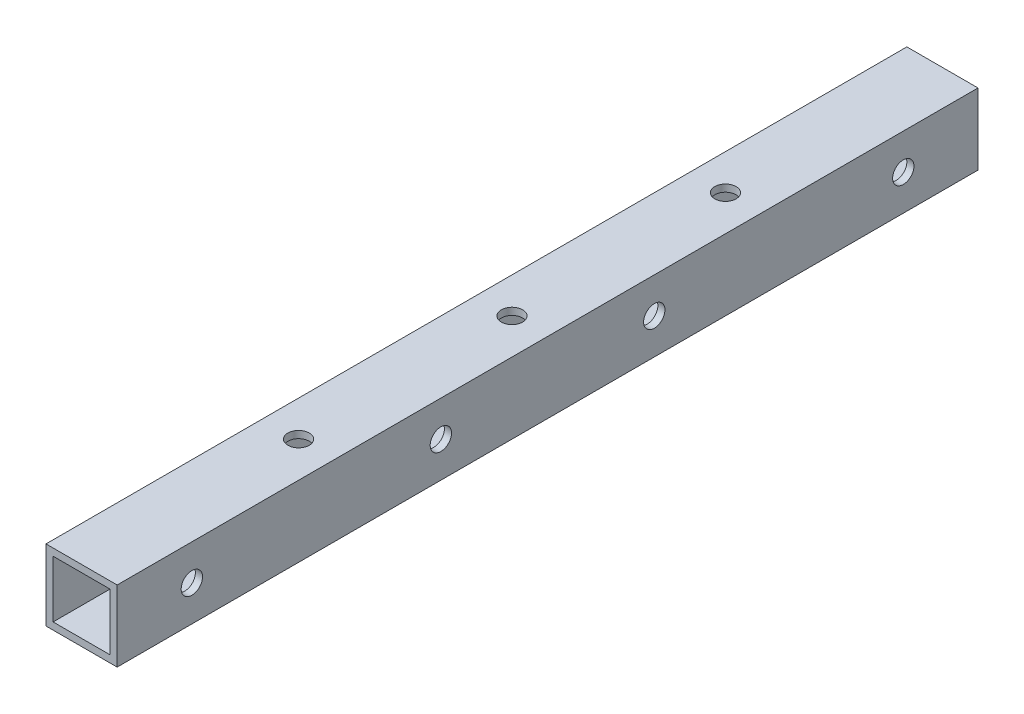
ISO-10303-21;
HEADER;
FILE_DESCRIPTION(('STEP AP214'),'2;1');
FILE_NAME('part.step','',(''),(''),'','','');
FILE_SCHEMA(('AUTOMOTIVE_DESIGN { 1 0 10303 214 1 1 1 1 }'));
ENDSEC;
DATA;
#1=APPLICATION_CONTEXT('core data for automotive mechanical design processes');
#2=APPLICATION_PROTOCOL_DEFINITION('international standard','automotive_design',2000,#1);
#3=PRODUCT_CONTEXT('',#1,'mechanical');
#4=PRODUCT('Part','Part','',(#3));
#5=PRODUCT_RELATED_PRODUCT_CATEGORY('part','',(#4));
#6=PRODUCT_DEFINITION_FORMATION('','',#4);
#7=PRODUCT_DEFINITION_CONTEXT('part definition',#1,'design');
#8=PRODUCT_DEFINITION('design','',#6,#7);
#9=PRODUCT_DEFINITION_SHAPE('','',#8);
#10=(LENGTH_UNIT() NAMED_UNIT(*) SI_UNIT(.MILLI.,.METRE.));
#11=(NAMED_UNIT(*) PLANE_ANGLE_UNIT() SI_UNIT($,.RADIAN.));
#12=(NAMED_UNIT(*) SI_UNIT($,.STERADIAN.) SOLID_ANGLE_UNIT());
#13=UNCERTAINTY_MEASURE_WITH_UNIT(LENGTH_MEASURE(1.E-05),#10,'distance_accuracy_value','');
#14=(GEOMETRIC_REPRESENTATION_CONTEXT(3) GLOBAL_UNCERTAINTY_ASSIGNED_CONTEXT((#13)) GLOBAL_UNIT_ASSIGNED_CONTEXT((#10,
#11,#12)) REPRESENTATION_CONTEXT('',''));
#15=CARTESIAN_POINT('',(0.,0.,0.));
#16=DIRECTION('',(0.,0.,1.));
#17=DIRECTION('',(1.,0.,0.));
#18=AXIS2_PLACEMENT_3D('',#15,#16,#17);
#19=CARTESIAN_POINT('',(0.,0.,121.));
#20=DIRECTION('',(0.,0.,1.));
#21=DIRECTION('',(1.,0.,0.));
#22=AXIS2_PLACEMENT_3D('',#19,#20,#21);
#23=PLANE('',#22);
#24=DIRECTION('',(-1.,0.,0.));
#25=VECTOR('',#24,1.);
#26=CARTESIAN_POINT('',(0.,5.,121.));
#27=LINE('',#26,#25);
#28=CARTESIAN_POINT('',(4.99999999999999,5.,121.));
#29=VERTEX_POINT('',#28);
#30=CARTESIAN_POINT('',(-5.,5.,121.));
#31=VERTEX_POINT('',#30);
#32=EDGE_CURVE('E167',#29,#31,#27,.T.);
#33=ORIENTED_EDGE('',*,*,#32,.T.);
#34=DIRECTION('',(0.,-1.,0.));
#35=VECTOR('',#34,1.);
#36=CARTESIAN_POINT('',(-5.,0.,121.));
#37=LINE('',#36,#35);
#38=CARTESIAN_POINT('',(-5.,-4.99999999999999,121.));
#39=VERTEX_POINT('',#38);
#40=EDGE_CURVE('E170',#31,#39,#37,.T.);
#41=ORIENTED_EDGE('',*,*,#40,.T.);
#42=DIRECTION('',(-1.,0.,0.));
#43=VECTOR('',#42,1.);
#44=CARTESIAN_POINT('',(0.,-4.99999999999999,121.));
#45=LINE('',#44,#43);
#46=CARTESIAN_POINT('',(4.99999999999999,-4.99999999999999,121.));
#47=VERTEX_POINT('',#46);
#48=EDGE_CURVE('E173',#47,#39,#45,.T.);
#49=ORIENTED_EDGE('',*,*,#48,.F.);
#50=DIRECTION('',(0.,-1.,0.));
#51=VECTOR('',#50,1.);
#52=CARTESIAN_POINT('',(4.99999999999999,0.,121.));
#53=LINE('',#52,#51);
#54=EDGE_CURVE('E176',#29,#47,#53,.T.);
#55=ORIENTED_EDGE('',*,*,#54,.F.);
#56=EDGE_LOOP('',(#33,#41,#49,#55));
#57=FACE_BOUND('',#56,.T.);
#58=DIRECTION('',(0.,-1.,0.));
#59=VECTOR('',#58,1.);
#60=CARTESIAN_POINT('',(-4.,0.,121.));
#61=LINE('',#60,#59);
#62=CARTESIAN_POINT('',(-4.,4.,121.));
#63=VERTEX_POINT('',#62);
#64=CARTESIAN_POINT('',(-4.,-3.99999999999999,121.));
#65=VERTEX_POINT('',#64);
#66=EDGE_CURVE('E139',#63,#65,#61,.T.);
#67=ORIENTED_EDGE('',*,*,#66,.F.);
#68=DIRECTION('',(-1.,0.,0.));
#69=VECTOR('',#68,1.);
#70=CARTESIAN_POINT('',(0.,4.,121.));
#71=LINE('',#70,#69);
#72=CARTESIAN_POINT('',(3.99999999999999,4.,121.));
#73=VERTEX_POINT('',#72);
#74=EDGE_CURVE('E130',#73,#63,#71,.T.);
#75=ORIENTED_EDGE('',*,*,#74,.F.);
#76=DIRECTION('',(0.,-1.,0.));
#77=VECTOR('',#76,1.);
#78=CARTESIAN_POINT('',(3.99999999999999,0.,121.));
#79=LINE('',#78,#77);
#80=CARTESIAN_POINT('',(3.99999999999999,-3.99999999999999,121.));
#81=VERTEX_POINT('',#80);
#82=EDGE_CURVE('E150',#73,#81,#79,.T.);
#83=ORIENTED_EDGE('',*,*,#82,.T.);
#84=DIRECTION('',(-1.,0.,0.));
#85=VECTOR('',#84,1.);
#86=CARTESIAN_POINT('',(0.,-3.99999999999999,121.));
#87=LINE('',#86,#85);
#88=EDGE_CURVE('E80',#81,#65,#87,.T.);
#89=ORIENTED_EDGE('',*,*,#88,.T.);
#90=EDGE_LOOP('',(#67,#75,#83,#89));
#91=FACE_BOUND('',#90,.T.);
#92=ADVANCED_FACE('F63',(#57,#91),#23,.T.);
#93=CARTESIAN_POINT('',(0.,0.,0.));
#94=DIRECTION('',(0.,0.,1.));
#95=DIRECTION('',(1.,0.,0.));
#96=AXIS2_PLACEMENT_3D('',#93,#94,#95);
#97=PLANE('',#96);
#98=DIRECTION('',(-1.,0.,0.));
#99=VECTOR('',#98,1.);
#100=CARTESIAN_POINT('',(0.,5.,0.));
#101=LINE('',#100,#99);
#102=CARTESIAN_POINT('',(4.99999999999999,5.,0.));
#103=VERTEX_POINT('',#102);
#104=CARTESIAN_POINT('',(-5.,5.,0.));
#105=VERTEX_POINT('',#104);
#106=EDGE_CURVE('E146',#103,#105,#101,.T.);
#107=ORIENTED_EDGE('',*,*,#106,.F.);
#108=DIRECTION('',(0.,-1.,0.));
#109=VECTOR('',#108,1.);
#110=CARTESIAN_POINT('',(4.99999999999999,0.,0.));
#111=LINE('',#110,#109);
#112=CARTESIAN_POINT('',(4.99999999999999,-4.99999999999999,0.));
#113=VERTEX_POINT('',#112);
#114=EDGE_CURVE('E171',#103,#113,#111,.T.);
#115=ORIENTED_EDGE('',*,*,#114,.T.);
#116=DIRECTION('',(-1.,0.,0.));
#117=VECTOR('',#116,1.);
#118=CARTESIAN_POINT('',(0.,-4.99999999999999,0.));
#119=LINE('',#118,#117);
#120=CARTESIAN_POINT('',(-5.,-4.99999999999999,0.));
#121=VERTEX_POINT('',#120);
#122=EDGE_CURVE('E185',#113,#121,#119,.T.);
#123=ORIENTED_EDGE('',*,*,#122,.T.);
#124=DIRECTION('',(0.,-1.,0.));
#125=VECTOR('',#124,1.);
#126=CARTESIAN_POINT('',(-5.,0.,0.));
#127=LINE('',#126,#125);
#128=EDGE_CURVE('E182',#105,#121,#127,.T.);
#129=ORIENTED_EDGE('',*,*,#128,.F.);
#130=EDGE_LOOP('',(#107,#115,#123,#129));
#131=FACE_BOUND('',#130,.T.);
#132=DIRECTION('',(-1.,0.,0.));
#133=VECTOR('',#132,1.);
#134=CARTESIAN_POINT('',(0.,4.,0.));
#135=LINE('',#134,#133);
#136=CARTESIAN_POINT('',(3.99999999999999,4.,0.));
#137=VERTEX_POINT('',#136);
#138=CARTESIAN_POINT('',(-4.,4.,0.));
#139=VERTEX_POINT('',#138);
#140=EDGE_CURVE('E88',#137,#139,#135,.T.);
#141=ORIENTED_EDGE('',*,*,#140,.T.);
#142=DIRECTION('',(0.,-1.,0.));
#143=VECTOR('',#142,1.);
#144=CARTESIAN_POINT('',(-4.,0.,0.));
#145=LINE('',#144,#143);
#146=CARTESIAN_POINT('',(-4.,-3.99999999999999,0.));
#147=VERTEX_POINT('',#146);
#148=EDGE_CURVE('E145',#139,#147,#145,.T.);
#149=ORIENTED_EDGE('',*,*,#148,.T.);
#150=DIRECTION('',(-1.,0.,0.));
#151=VECTOR('',#150,1.);
#152=CARTESIAN_POINT('',(0.,-3.99999999999999,0.));
#153=LINE('',#152,#151);
#154=CARTESIAN_POINT('',(3.99999999999999,-3.99999999999999,0.));
#155=VERTEX_POINT('',#154);
#156=EDGE_CURVE('E158',#155,#147,#153,.T.);
#157=ORIENTED_EDGE('',*,*,#156,.F.);
#158=DIRECTION('',(0.,-1.,0.));
#159=VECTOR('',#158,1.);
#160=CARTESIAN_POINT('',(3.99999999999999,0.,0.));
#161=LINE('',#160,#159);
#162=EDGE_CURVE('E140',#137,#155,#161,.T.);
#163=ORIENTED_EDGE('',*,*,#162,.F.);
#164=EDGE_LOOP('',(#141,#149,#157,#163));
#165=FACE_BOUND('',#164,.T.);
#166=ADVANCED_FACE('F295',(#131,#165),#97,.F.);
#167=CARTESIAN_POINT('',(0.,5.,121.));
#168=DIRECTION('',(0.,-1.,0.));
#169=DIRECTION('',(0.,0.,-1.));
#170=AXIS2_PLACEMENT_3D('',#167,#168,#169);
#171=PLANE('',#170);
#172=CARTESIAN_POINT('',(0.,5.,90.5));
#173=DIRECTION('',(0.,1.,0.));
#174=DIRECTION('',(0.,0.,1.));
#175=AXIS2_PLACEMENT_3D('',#172,#173,#174);
#176=CIRCLE('',#175,1.5);
#177=CARTESIAN_POINT('',(0.,5.,92.));
#178=VERTEX_POINT('',#177);
#179=EDGE_CURVE('E342',#178,#178,#176,.T.);
#180=ORIENTED_EDGE('',*,*,#179,.F.);
#181=EDGE_LOOP('',(#180));
#182=FACE_BOUND('',#181,.T.);
#183=CARTESIAN_POINT('',(0.,5.,30.5));
#184=DIRECTION('',(0.,1.,0.));
#185=DIRECTION('',(0.,0.,1.));
#186=AXIS2_PLACEMENT_3D('',#183,#184,#185);
#187=CIRCLE('',#186,1.5);
#188=CARTESIAN_POINT('',(0.,5.,32.));
#189=VERTEX_POINT('',#188);
#190=EDGE_CURVE('E339',#189,#189,#187,.T.);
#191=ORIENTED_EDGE('',*,*,#190,.F.);
#192=EDGE_LOOP('',(#191));
#193=FACE_BOUND('',#192,.T.);
#194=CARTESIAN_POINT('',(0.,5.,60.5));
#195=DIRECTION('',(0.,1.,0.));
#196=DIRECTION('',(0.,0.,1.));
#197=AXIS2_PLACEMENT_3D('',#194,#195,#196);
#198=CIRCLE('',#197,1.5);
#199=CARTESIAN_POINT('',(0.,5.,62.));
#200=VERTEX_POINT('',#199);
#201=EDGE_CURVE('E226',#200,#200,#198,.T.);
#202=ORIENTED_EDGE('',*,*,#201,.F.);
#203=EDGE_LOOP('',(#202));
#204=FACE_BOUND('',#203,.T.);
#205=ORIENTED_EDGE('',*,*,#106,.T.);
#206=DIRECTION('',(0.,0.,-1.));
#207=VECTOR('',#206,1.);
#208=CARTESIAN_POINT('',(-5.,5.,121.));
#209=LINE('',#208,#207);
#210=EDGE_CURVE('E12',#31,#105,#209,.T.);
#211=ORIENTED_EDGE('',*,*,#210,.F.);
#212=ORIENTED_EDGE('',*,*,#32,.F.);
#213=DIRECTION('',(0.,0.,-1.));
#214=VECTOR('',#213,1.);
#215=CARTESIAN_POINT('',(4.99999999999999,5.,121.));
#216=LINE('',#215,#214);
#217=EDGE_CURVE('E179',#29,#103,#216,.T.);
#218=ORIENTED_EDGE('',*,*,#217,.T.);
#219=EDGE_LOOP('',(#205,#211,#212,#218));
#220=FACE_BOUND('',#219,.T.);
#221=ADVANCED_FACE('F65',(#182,#193,#204,#220),#171,.F.);
#222=CARTESIAN_POINT('',(-5.,0.,121.));
#223=DIRECTION('',(1.,0.,0.));
#224=DIRECTION('',(0.,0.,-1.));
#225=AXIS2_PLACEMENT_3D('',#222,#223,#224);
#226=PLANE('',#225);
#227=CARTESIAN_POINT('',(-5.,0.,110.5));
#228=DIRECTION('',(1.,0.,0.));
#229=DIRECTION('',(0.,0.,-1.));
#230=AXIS2_PLACEMENT_3D('',#227,#228,#229);
#231=CIRCLE('',#230,1.5);
#232=CARTESIAN_POINT('',(-5.,0.,109.));
#233=VERTEX_POINT('',#232);
#234=EDGE_CURVE('E198',#233,#233,#231,.T.);
#235=ORIENTED_EDGE('',*,*,#234,.T.);
#236=EDGE_LOOP('',(#235));
#237=FACE_BOUND('',#236,.T.);
#238=CARTESIAN_POINT('',(-5.,0.,75.5));
#239=DIRECTION('',(1.,0.,0.));
#240=DIRECTION('',(0.,0.,-1.));
#241=AXIS2_PLACEMENT_3D('',#238,#239,#240);
#242=CIRCLE('',#241,1.50000000000003);
#243=CARTESIAN_POINT('',(-5.,0.,74.));
#244=VERTEX_POINT('',#243);
#245=EDGE_CURVE('E241',#244,#244,#242,.T.);
#246=ORIENTED_EDGE('',*,*,#245,.T.);
#247=EDGE_LOOP('',(#246));
#248=FACE_BOUND('',#247,.T.);
#249=CARTESIAN_POINT('',(-5.,0.,45.5));
#250=DIRECTION('',(1.,0.,0.));
#251=DIRECTION('',(0.,0.,-1.));
#252=AXIS2_PLACEMENT_3D('',#249,#250,#251);
#253=CIRCLE('',#252,1.5);
#254=CARTESIAN_POINT('',(-5.,0.,44.));
#255=VERTEX_POINT('',#254);
#256=EDGE_CURVE('E247',#255,#255,#253,.T.);
#257=ORIENTED_EDGE('',*,*,#256,.T.);
#258=EDGE_LOOP('',(#257));
#259=FACE_BOUND('',#258,.T.);
#260=CARTESIAN_POINT('',(-5.,0.,10.5));
#261=DIRECTION('',(1.,0.,0.));
#262=DIRECTION('',(0.,0.,-1.));
#263=AXIS2_PLACEMENT_3D('',#260,#261,#262);
#264=CIRCLE('',#263,1.5);
#265=CARTESIAN_POINT('',(-5.,0.,8.99999999999999));
#266=VERTEX_POINT('',#265);
#267=EDGE_CURVE('E232',#266,#266,#264,.T.);
#268=ORIENTED_EDGE('',*,*,#267,.T.);
#269=EDGE_LOOP('',(#268));
#270=FACE_BOUND('',#269,.T.);
#271=ORIENTED_EDGE('',*,*,#128,.T.);
#272=DIRECTION('',(0.,0.,-1.));
#273=VECTOR('',#272,1.);
#274=CARTESIAN_POINT('',(-5.,-4.99999999999999,121.));
#275=LINE('',#274,#273);
#276=EDGE_CURVE('E72',#39,#121,#275,.T.);
#277=ORIENTED_EDGE('',*,*,#276,.F.);
#278=ORIENTED_EDGE('',*,*,#40,.F.);
#279=ORIENTED_EDGE('',*,*,#210,.T.);
#280=EDGE_LOOP('',(#271,#277,#278,#279));
#281=FACE_BOUND('',#280,.T.);
#282=ADVANCED_FACE('F285',(#237,#248,#259,#270,#281),#226,.F.);
#283=CARTESIAN_POINT('',(0.,-4.99999999999999,121.));
#284=DIRECTION('',(0.,-1.,0.));
#285=DIRECTION('',(0.,0.,-1.));
#286=AXIS2_PLACEMENT_3D('',#283,#284,#285);
#287=PLANE('',#286);
#288=CARTESIAN_POINT('',(0.,-4.99999999999999,90.5));
#289=DIRECTION('',(0.,1.,0.));
#290=DIRECTION('',(0.,0.,1.));
#291=AXIS2_PLACEMENT_3D('',#288,#289,#290);
#292=CIRCLE('',#291,1.5);
#293=CARTESIAN_POINT('',(0.,-4.99999999999999,92.));
#294=VERTEX_POINT('',#293);
#295=EDGE_CURVE('E330',#294,#294,#292,.T.);
#296=ORIENTED_EDGE('',*,*,#295,.T.);
#297=EDGE_LOOP('',(#296));
#298=FACE_BOUND('',#297,.T.);
#299=CARTESIAN_POINT('',(0.,-4.99999999999999,30.5));
#300=DIRECTION('',(0.,1.,0.));
#301=DIRECTION('',(0.,0.,1.));
#302=AXIS2_PLACEMENT_3D('',#299,#300,#301);
#303=CIRCLE('',#302,1.5);
#304=CARTESIAN_POINT('',(0.,-4.99999999999999,32.));
#305=VERTEX_POINT('',#304);
#306=EDGE_CURVE('E334',#305,#305,#303,.T.);
#307=ORIENTED_EDGE('',*,*,#306,.T.);
#308=EDGE_LOOP('',(#307));
#309=FACE_BOUND('',#308,.T.);
#310=CARTESIAN_POINT('',(0.,-4.99999999999999,60.5));
#311=DIRECTION('',(0.,1.,0.));
#312=DIRECTION('',(0.,0.,1.));
#313=AXIS2_PLACEMENT_3D('',#310,#311,#312);
#314=CIRCLE('',#313,1.5);
#315=CARTESIAN_POINT('',(0.,-4.99999999999999,62.));
#316=VERTEX_POINT('',#315);
#317=EDGE_CURVE('E213',#316,#316,#314,.T.);
#318=ORIENTED_EDGE('',*,*,#317,.T.);
#319=EDGE_LOOP('',(#318));
#320=FACE_BOUND('',#319,.T.);
#321=ORIENTED_EDGE('',*,*,#122,.F.);
#322=DIRECTION('',(0.,0.,-1.));
#323=VECTOR('',#322,1.);
#324=CARTESIAN_POINT('',(4.99999999999999,-4.99999999999999,121.));
#325=LINE('',#324,#323);
#326=EDGE_CURVE('E191',#47,#113,#325,.T.);
#327=ORIENTED_EDGE('',*,*,#326,.F.);
#328=ORIENTED_EDGE('',*,*,#48,.T.);
#329=ORIENTED_EDGE('',*,*,#276,.T.);
#330=EDGE_LOOP('',(#321,#327,#328,#329));
#331=FACE_BOUND('',#330,.T.);
#332=ADVANCED_FACE('F288',(#298,#309,#320,#331),#287,.T.);
#333=CARTESIAN_POINT('',(4.99999999999999,0.,121.));
#334=DIRECTION('',(1.,0.,0.));
#335=DIRECTION('',(0.,0.,-1.));
#336=AXIS2_PLACEMENT_3D('',#333,#334,#335);
#337=PLANE('',#336);
#338=CARTESIAN_POINT('',(4.99999999999999,0.,110.5));
#339=DIRECTION('',(1.,0.,0.));
#340=DIRECTION('',(0.,0.,-1.));
#341=AXIS2_PLACEMENT_3D('',#338,#339,#340);
#342=CIRCLE('',#341,1.5);
#343=CARTESIAN_POINT('',(4.99999999999999,0.,109.));
#344=VERTEX_POINT('',#343);
#345=EDGE_CURVE('E235',#344,#344,#342,.T.);
#346=ORIENTED_EDGE('',*,*,#345,.F.);
#347=EDGE_LOOP('',(#346));
#348=FACE_BOUND('',#347,.T.);
#349=CARTESIAN_POINT('',(4.99999999999999,0.,75.5));
#350=DIRECTION('',(1.,0.,0.));
#351=DIRECTION('',(0.,0.,-1.));
#352=AXIS2_PLACEMENT_3D('',#349,#350,#351);
#353=CIRCLE('',#352,1.50000000000003);
#354=CARTESIAN_POINT('',(4.99999999999999,0.,74.));
#355=VERTEX_POINT('',#354);
#356=EDGE_CURVE('E238',#355,#355,#353,.T.);
#357=ORIENTED_EDGE('',*,*,#356,.F.);
#358=EDGE_LOOP('',(#357));
#359=FACE_BOUND('',#358,.T.);
#360=CARTESIAN_POINT('',(4.99999999999999,0.,45.5));
#361=DIRECTION('',(1.,0.,0.));
#362=DIRECTION('',(0.,0.,-1.));
#363=AXIS2_PLACEMENT_3D('',#360,#361,#362);
#364=CIRCLE('',#363,1.5);
#365=CARTESIAN_POINT('',(4.99999999999999,0.,44.));
#366=VERTEX_POINT('',#365);
#367=EDGE_CURVE('E244',#366,#366,#364,.T.);
#368=ORIENTED_EDGE('',*,*,#367,.F.);
#369=EDGE_LOOP('',(#368));
#370=FACE_BOUND('',#369,.T.);
#371=CARTESIAN_POINT('',(4.99999999999999,0.,10.5));
#372=DIRECTION('',(1.,0.,0.));
#373=DIRECTION('',(0.,0.,-1.));
#374=AXIS2_PLACEMENT_3D('',#371,#372,#373);
#375=CIRCLE('',#374,1.5);
#376=CARTESIAN_POINT('',(4.99999999999999,0.,8.99999999999999));
#377=VERTEX_POINT('',#376);
#378=EDGE_CURVE('E250',#377,#377,#375,.T.);
#379=ORIENTED_EDGE('',*,*,#378,.F.);
#380=EDGE_LOOP('',(#379));
#381=FACE_BOUND('',#380,.T.);
#382=ORIENTED_EDGE('',*,*,#114,.F.);
#383=ORIENTED_EDGE('',*,*,#217,.F.);
#384=ORIENTED_EDGE('',*,*,#54,.T.);
#385=ORIENTED_EDGE('',*,*,#326,.T.);
#386=EDGE_LOOP('',(#382,#383,#384,#385));
#387=FACE_BOUND('',#386,.T.);
#388=ADVANCED_FACE('F303',(#348,#359,#370,#381,#387),#337,.T.);
#389=CARTESIAN_POINT('',(0.,4.,121.));
#390=DIRECTION('',(0.,-1.,0.));
#391=DIRECTION('',(0.,0.,-1.));
#392=AXIS2_PLACEMENT_3D('',#389,#390,#391);
#393=PLANE('',#392);
#394=CARTESIAN_POINT('',(0.,4.,90.5));
#395=DIRECTION('',(0.,-1.,0.));
#396=DIRECTION('',(0.,0.,-1.));
#397=AXIS2_PLACEMENT_3D('',#394,#395,#396);
#398=CIRCLE('',#397,1.5);
#399=CARTESIAN_POINT('',(0.,4.,89.));
#400=VERTEX_POINT('',#399);
#401=EDGE_CURVE('E229',#400,#400,#398,.T.);
#402=ORIENTED_EDGE('',*,*,#401,.F.);
#403=EDGE_LOOP('',(#402));
#404=FACE_BOUND('',#403,.T.);
#405=CARTESIAN_POINT('',(0.,4.,30.5));
#406=DIRECTION('',(0.,-1.,0.));
#407=DIRECTION('',(0.,0.,-1.));
#408=AXIS2_PLACEMENT_3D('',#405,#406,#407);
#409=CIRCLE('',#408,1.5);
#410=CARTESIAN_POINT('',(0.,4.,29.));
#411=VERTEX_POINT('',#410);
#412=EDGE_CURVE('E216',#411,#411,#409,.T.);
#413=ORIENTED_EDGE('',*,*,#412,.F.);
#414=EDGE_LOOP('',(#413));
#415=FACE_BOUND('',#414,.T.);
#416=CARTESIAN_POINT('',(0.,4.,60.5));
#417=DIRECTION('',(0.,-1.,0.));
#418=DIRECTION('',(0.,0.,-1.));
#419=AXIS2_PLACEMENT_3D('',#416,#417,#418);
#420=CIRCLE('',#419,1.5);
#421=CARTESIAN_POINT('',(0.,4.,59.));
#422=VERTEX_POINT('',#421);
#423=EDGE_CURVE('E212',#422,#422,#420,.T.);
#424=ORIENTED_EDGE('',*,*,#423,.F.);
#425=EDGE_LOOP('',(#424));
#426=FACE_BOUND('',#425,.T.);
#427=ORIENTED_EDGE('',*,*,#140,.F.);
#428=DIRECTION('',(0.,0.,-1.));
#429=VECTOR('',#428,1.);
#430=CARTESIAN_POINT('',(3.99999999999999,4.,121.));
#431=LINE('',#430,#429);
#432=EDGE_CURVE('E134',#73,#137,#431,.T.);
#433=ORIENTED_EDGE('',*,*,#432,.F.);
#434=ORIENTED_EDGE('',*,*,#74,.T.);
#435=DIRECTION('',(0.,0.,-1.));
#436=VECTOR('',#435,1.);
#437=CARTESIAN_POINT('',(-4.,4.,121.));
#438=LINE('',#437,#436);
#439=EDGE_CURVE('E133',#63,#139,#438,.T.);
#440=ORIENTED_EDGE('',*,*,#439,.T.);
#441=EDGE_LOOP('',(#427,#433,#434,#440));
#442=FACE_BOUND('',#441,.T.);
#443=ADVANCED_FACE('F132',(#404,#415,#426,#442),#393,.T.);
#444=CARTESIAN_POINT('',(-4.,0.,121.));
#445=DIRECTION('',(1.,0.,0.));
#446=DIRECTION('',(0.,0.,-1.));
#447=AXIS2_PLACEMENT_3D('',#444,#445,#446);
#448=PLANE('',#447);
#449=CARTESIAN_POINT('',(-4.,0.,110.5));
#450=DIRECTION('',(1.,0.,0.));
#451=DIRECTION('',(0.,0.,-1.));
#452=AXIS2_PLACEMENT_3D('',#449,#450,#451);
#453=CIRCLE('',#452,1.5);
#454=CARTESIAN_POINT('',(-4.,0.,109.));
#455=VERTEX_POINT('',#454);
#456=EDGE_CURVE('E156',#455,#455,#453,.T.);
#457=ORIENTED_EDGE('',*,*,#456,.F.);
#458=EDGE_LOOP('',(#457));
#459=FACE_BOUND('',#458,.T.);
#460=CARTESIAN_POINT('',(-4.,0.,75.5));
#461=DIRECTION('',(1.,0.,0.));
#462=DIRECTION('',(0.,0.,-1.));
#463=AXIS2_PLACEMENT_3D('',#460,#461,#462);
#464=CIRCLE('',#463,1.50000000000003);
#465=CARTESIAN_POINT('',(-4.,0.,74.));
#466=VERTEX_POINT('',#465);
#467=EDGE_CURVE('E206',#466,#466,#464,.T.);
#468=ORIENTED_EDGE('',*,*,#467,.F.);
#469=EDGE_LOOP('',(#468));
#470=FACE_BOUND('',#469,.T.);
#471=CARTESIAN_POINT('',(-4.,0.,45.5));
#472=DIRECTION('',(1.,0.,0.));
#473=DIRECTION('',(0.,0.,-1.));
#474=AXIS2_PLACEMENT_3D('',#471,#472,#473);
#475=CIRCLE('',#474,1.5);
#476=CARTESIAN_POINT('',(-4.,0.,44.));
#477=VERTEX_POINT('',#476);
#478=EDGE_CURVE('E202',#477,#477,#475,.T.);
#479=ORIENTED_EDGE('',*,*,#478,.F.);
#480=EDGE_LOOP('',(#479));
#481=FACE_BOUND('',#480,.T.);
#482=CARTESIAN_POINT('',(-4.,0.,10.5));
#483=DIRECTION('',(1.,0.,0.));
#484=DIRECTION('',(0.,0.,-1.));
#485=AXIS2_PLACEMENT_3D('',#482,#483,#484);
#486=CIRCLE('',#485,1.5);
#487=CARTESIAN_POINT('',(-4.,0.,8.99999999999999));
#488=VERTEX_POINT('',#487);
#489=EDGE_CURVE('E197',#488,#488,#486,.T.);
#490=ORIENTED_EDGE('',*,*,#489,.F.);
#491=EDGE_LOOP('',(#490));
#492=FACE_BOUND('',#491,.T.);
#493=ORIENTED_EDGE('',*,*,#148,.F.);
#494=ORIENTED_EDGE('',*,*,#439,.F.);
#495=ORIENTED_EDGE('',*,*,#66,.T.);
#496=DIRECTION('',(0.,0.,-1.));
#497=VECTOR('',#496,1.);
#498=CARTESIAN_POINT('',(-4.,-3.99999999999999,121.));
#499=LINE('',#498,#497);
#500=EDGE_CURVE('E147',#65,#147,#499,.T.);
#501=ORIENTED_EDGE('',*,*,#500,.T.);
#502=EDGE_LOOP('',(#493,#494,#495,#501));
#503=FACE_BOUND('',#502,.T.);
#504=ADVANCED_FACE('F143',(#459,#470,#481,#492,#503),#448,.T.);
#505=CARTESIAN_POINT('',(0.,-3.99999999999999,121.));
#506=DIRECTION('',(0.,-1.,0.));
#507=DIRECTION('',(0.,0.,-1.));
#508=AXIS2_PLACEMENT_3D('',#505,#506,#507);
#509=PLANE('',#508);
#510=CARTESIAN_POINT('',(0.,-3.99999999999999,90.5));
#511=DIRECTION('',(0.,-1.,0.));
#512=DIRECTION('',(0.,0.,-1.));
#513=AXIS2_PLACEMENT_3D('',#510,#511,#512);
#514=CIRCLE('',#513,1.5);
#515=CARTESIAN_POINT('',(0.,-3.99999999999999,89.));
#516=VERTEX_POINT('',#515);
#517=EDGE_CURVE('E67',#516,#516,#514,.T.);
#518=ORIENTED_EDGE('',*,*,#517,.T.);
#519=EDGE_LOOP('',(#518));
#520=FACE_BOUND('',#519,.T.);
#521=CARTESIAN_POINT('',(0.,-3.99999999999999,30.5));
#522=DIRECTION('',(0.,-1.,0.));
#523=DIRECTION('',(0.,0.,-1.));
#524=AXIS2_PLACEMENT_3D('',#521,#522,#523);
#525=CIRCLE('',#524,1.5);
#526=CARTESIAN_POINT('',(0.,-3.99999999999999,29.));
#527=VERTEX_POINT('',#526);
#528=EDGE_CURVE('E214',#527,#527,#525,.T.);
#529=ORIENTED_EDGE('',*,*,#528,.T.);
#530=EDGE_LOOP('',(#529));
#531=FACE_BOUND('',#530,.T.);
#532=CARTESIAN_POINT('',(0.,-3.99999999999999,60.5));
#533=DIRECTION('',(0.,-1.,0.));
#534=DIRECTION('',(0.,0.,-1.));
#535=AXIS2_PLACEMENT_3D('',#532,#533,#534);
#536=CIRCLE('',#535,1.5);
#537=CARTESIAN_POINT('',(0.,-3.99999999999999,59.));
#538=VERTEX_POINT('',#537);
#539=EDGE_CURVE('E210',#538,#538,#536,.T.);
#540=ORIENTED_EDGE('',*,*,#539,.T.);
#541=EDGE_LOOP('',(#540));
#542=FACE_BOUND('',#541,.T.);
#543=ORIENTED_EDGE('',*,*,#156,.T.);
#544=ORIENTED_EDGE('',*,*,#500,.F.);
#545=ORIENTED_EDGE('',*,*,#88,.F.);
#546=DIRECTION('',(0.,0.,-1.));
#547=VECTOR('',#546,1.);
#548=CARTESIAN_POINT('',(3.99999999999999,-3.99999999999999,121.));
#549=LINE('',#548,#547);
#550=EDGE_CURVE('E164',#81,#155,#549,.T.);
#551=ORIENTED_EDGE('',*,*,#550,.T.);
#552=EDGE_LOOP('',(#543,#544,#545,#551));
#553=FACE_BOUND('',#552,.T.);
#554=ADVANCED_FACE('F268',(#520,#531,#542,#553),#509,.F.);
#555=CARTESIAN_POINT('',(3.99999999999999,0.,121.));
#556=DIRECTION('',(1.,0.,0.));
#557=DIRECTION('',(0.,0.,-1.));
#558=AXIS2_PLACEMENT_3D('',#555,#556,#557);
#559=PLANE('',#558);
#560=CARTESIAN_POINT('',(3.99999999999999,0.,110.5));
#561=DIRECTION('',(1.,0.,0.));
#562=DIRECTION('',(0.,0.,-1.));
#563=AXIS2_PLACEMENT_3D('',#560,#561,#562);
#564=CIRCLE('',#563,1.5);
#565=CARTESIAN_POINT('',(3.99999999999999,0.,109.));
#566=VERTEX_POINT('',#565);
#567=EDGE_CURVE('E207',#566,#566,#564,.T.);
#568=ORIENTED_EDGE('',*,*,#567,.T.);
#569=EDGE_LOOP('',(#568));
#570=FACE_BOUND('',#569,.T.);
#571=CARTESIAN_POINT('',(3.99999999999999,0.,75.5));
#572=DIRECTION('',(1.,0.,0.));
#573=DIRECTION('',(0.,0.,-1.));
#574=AXIS2_PLACEMENT_3D('',#571,#572,#573);
#575=CIRCLE('',#574,1.50000000000003);
#576=CARTESIAN_POINT('',(3.99999999999999,0.,74.));
#577=VERTEX_POINT('',#576);
#578=EDGE_CURVE('E203',#577,#577,#575,.T.);
#579=ORIENTED_EDGE('',*,*,#578,.T.);
#580=EDGE_LOOP('',(#579));
#581=FACE_BOUND('',#580,.T.);
#582=CARTESIAN_POINT('',(3.99999999999999,0.,45.5));
#583=DIRECTION('',(1.,0.,0.));
#584=DIRECTION('',(0.,0.,-1.));
#585=AXIS2_PLACEMENT_3D('',#582,#583,#584);
#586=CIRCLE('',#585,1.5);
#587=CARTESIAN_POINT('',(3.99999999999999,0.,44.));
#588=VERTEX_POINT('',#587);
#589=EDGE_CURVE('E199',#588,#588,#586,.T.);
#590=ORIENTED_EDGE('',*,*,#589,.T.);
#591=EDGE_LOOP('',(#590));
#592=FACE_BOUND('',#591,.T.);
#593=CARTESIAN_POINT('',(3.99999999999999,0.,10.5));
#594=DIRECTION('',(1.,0.,0.));
#595=DIRECTION('',(0.,0.,-1.));
#596=AXIS2_PLACEMENT_3D('',#593,#594,#595);
#597=CIRCLE('',#596,1.5);
#598=CARTESIAN_POINT('',(3.99999999999999,0.,8.99999999999999));
#599=VERTEX_POINT('',#598);
#600=EDGE_CURVE('E194',#599,#599,#597,.T.);
#601=ORIENTED_EDGE('',*,*,#600,.T.);
#602=EDGE_LOOP('',(#601));
#603=FACE_BOUND('',#602,.T.);
#604=ORIENTED_EDGE('',*,*,#162,.T.);
#605=ORIENTED_EDGE('',*,*,#550,.F.);
#606=ORIENTED_EDGE('',*,*,#82,.F.);
#607=ORIENTED_EDGE('',*,*,#432,.T.);
#608=EDGE_LOOP('',(#604,#605,#606,#607));
#609=FACE_BOUND('',#608,.T.);
#610=ADVANCED_FACE('F380',(#570,#581,#592,#603,#609),#559,.F.);
#611=CARTESIAN_POINT('',(-5.,0.,10.5));
#612=DIRECTION('',(1.,0.,0.));
#613=DIRECTION('',(0.,0.,-1.));
#614=AXIS2_PLACEMENT_3D('',#611,#612,#613);
#615=CYLINDRICAL_SURFACE('',#614,1.5);
#616=ORIENTED_EDGE('',*,*,#378,.T.);
#617=EDGE_LOOP('',(#616));
#618=FACE_BOUND('',#617,.T.);
#619=ORIENTED_EDGE('',*,*,#600,.F.);
#620=EDGE_LOOP('',(#619));
#621=FACE_BOUND('',#620,.T.);
#622=ADVANCED_FACE('F282',(#618,#621),#615,.F.);
#623=CARTESIAN_POINT('',(-5.,0.,45.5));
#624=DIRECTION('',(1.,0.,0.));
#625=DIRECTION('',(0.,0.,-1.));
#626=AXIS2_PLACEMENT_3D('',#623,#624,#625);
#627=CYLINDRICAL_SURFACE('',#626,1.5);
#628=ORIENTED_EDGE('',*,*,#367,.T.);
#629=EDGE_LOOP('',(#628));
#630=FACE_BOUND('',#629,.T.);
#631=ORIENTED_EDGE('',*,*,#589,.F.);
#632=EDGE_LOOP('',(#631));
#633=FACE_BOUND('',#632,.T.);
#634=ADVANCED_FACE('F392',(#630,#633),#627,.F.);
#635=CARTESIAN_POINT('',(-5.,0.,75.5));
#636=DIRECTION('',(1.,0.,0.));
#637=DIRECTION('',(0.,0.,-1.));
#638=AXIS2_PLACEMENT_3D('',#635,#636,#637);
#639=CYLINDRICAL_SURFACE('',#638,1.50000000000003);
#640=ORIENTED_EDGE('',*,*,#356,.T.);
#641=EDGE_LOOP('',(#640));
#642=FACE_BOUND('',#641,.T.);
#643=ORIENTED_EDGE('',*,*,#578,.F.);
#644=EDGE_LOOP('',(#643));
#645=FACE_BOUND('',#644,.T.);
#646=ADVANCED_FACE('F401',(#642,#645),#639,.F.);
#647=CARTESIAN_POINT('',(-5.,0.,110.5));
#648=DIRECTION('',(1.,0.,0.));
#649=DIRECTION('',(0.,0.,-1.));
#650=AXIS2_PLACEMENT_3D('',#647,#648,#649);
#651=CYLINDRICAL_SURFACE('',#650,1.5);
#652=ORIENTED_EDGE('',*,*,#345,.T.);
#653=EDGE_LOOP('',(#652));
#654=FACE_BOUND('',#653,.T.);
#655=ORIENTED_EDGE('',*,*,#567,.F.);
#656=EDGE_LOOP('',(#655));
#657=FACE_BOUND('',#656,.T.);
#658=ADVANCED_FACE('F280',(#654,#657),#651,.F.);
#659=ORIENTED_EDGE('',*,*,#489,.T.);
#660=EDGE_LOOP('',(#659));
#661=FACE_BOUND('',#660,.T.);
#662=ORIENTED_EDGE('',*,*,#267,.F.);
#663=EDGE_LOOP('',(#662));
#664=FACE_BOUND('',#663,.T.);
#665=ADVANCED_FACE('F276',(#661,#664),#615,.F.);
#666=ORIENTED_EDGE('',*,*,#478,.T.);
#667=EDGE_LOOP('',(#666));
#668=FACE_BOUND('',#667,.T.);
#669=ORIENTED_EDGE('',*,*,#256,.F.);
#670=EDGE_LOOP('',(#669));
#671=FACE_BOUND('',#670,.T.);
#672=ADVANCED_FACE('F279',(#668,#671),#627,.F.);
#673=ORIENTED_EDGE('',*,*,#467,.T.);
#674=EDGE_LOOP('',(#673));
#675=FACE_BOUND('',#674,.T.);
#676=ORIENTED_EDGE('',*,*,#245,.F.);
#677=EDGE_LOOP('',(#676));
#678=FACE_BOUND('',#677,.T.);
#679=ADVANCED_FACE('F375',(#675,#678),#639,.F.);
#680=ORIENTED_EDGE('',*,*,#456,.T.);
#681=EDGE_LOOP('',(#680));
#682=FACE_BOUND('',#681,.T.);
#683=ORIENTED_EDGE('',*,*,#234,.F.);
#684=EDGE_LOOP('',(#683));
#685=FACE_BOUND('',#684,.T.);
#686=ADVANCED_FACE('F263',(#682,#685),#651,.F.);
#687=CARTESIAN_POINT('',(0.,-4.99999999999999,60.5));
#688=DIRECTION('',(0.,1.,0.));
#689=DIRECTION('',(0.,0.,1.));
#690=AXIS2_PLACEMENT_3D('',#687,#688,#689);
#691=CYLINDRICAL_SURFACE('',#690,1.5);
#692=ORIENTED_EDGE('',*,*,#317,.F.);
#693=EDGE_LOOP('',(#692));
#694=FACE_BOUND('',#693,.T.);
#695=ORIENTED_EDGE('',*,*,#539,.F.);
#696=EDGE_LOOP('',(#695));
#697=FACE_BOUND('',#696,.T.);
#698=ADVANCED_FACE('F357',(#694,#697),#691,.F.);
#699=CARTESIAN_POINT('',(0.,-4.99999999999999,30.5));
#700=DIRECTION('',(0.,1.,0.));
#701=DIRECTION('',(0.,0.,1.));
#702=AXIS2_PLACEMENT_3D('',#699,#700,#701);
#703=CYLINDRICAL_SURFACE('',#702,1.5);
#704=ORIENTED_EDGE('',*,*,#306,.F.);
#705=EDGE_LOOP('',(#704));
#706=FACE_BOUND('',#705,.T.);
#707=ORIENTED_EDGE('',*,*,#528,.F.);
#708=EDGE_LOOP('',(#707));
#709=FACE_BOUND('',#708,.T.);
#710=ADVANCED_FACE('F365',(#706,#709),#703,.F.);
#711=CARTESIAN_POINT('',(0.,-4.99999999999999,90.5));
#712=DIRECTION('',(0.,1.,0.));
#713=DIRECTION('',(0.,0.,1.));
#714=AXIS2_PLACEMENT_3D('',#711,#712,#713);
#715=CYLINDRICAL_SURFACE('',#714,1.5);
#716=ORIENTED_EDGE('',*,*,#295,.F.);
#717=EDGE_LOOP('',(#716));
#718=FACE_BOUND('',#717,.T.);
#719=ORIENTED_EDGE('',*,*,#517,.F.);
#720=EDGE_LOOP('',(#719));
#721=FACE_BOUND('',#720,.T.);
#722=ADVANCED_FACE('F355',(#718,#721),#715,.F.);
#723=ORIENTED_EDGE('',*,*,#423,.T.);
#724=EDGE_LOOP('',(#723));
#725=FACE_BOUND('',#724,.T.);
#726=ORIENTED_EDGE('',*,*,#201,.T.);
#727=EDGE_LOOP('',(#726));
#728=FACE_BOUND('',#727,.T.);
#729=ADVANCED_FACE('F353',(#725,#728),#691,.F.);
#730=ORIENTED_EDGE('',*,*,#412,.T.);
#731=EDGE_LOOP('',(#730));
#732=FACE_BOUND('',#731,.T.);
#733=ORIENTED_EDGE('',*,*,#190,.T.);
#734=EDGE_LOOP('',(#733));
#735=FACE_BOUND('',#734,.T.);
#736=ADVANCED_FACE('F349',(#732,#735),#703,.F.);
#737=ORIENTED_EDGE('',*,*,#401,.T.);
#738=EDGE_LOOP('',(#737));
#739=FACE_BOUND('',#738,.T.);
#740=ORIENTED_EDGE('',*,*,#179,.T.);
#741=EDGE_LOOP('',(#740));
#742=FACE_BOUND('',#741,.T.);
#743=ADVANCED_FACE('F362',(#739,#742),#715,.F.);
#744=CLOSED_SHELL('',(#92,#166,#221,#282,#332,#388,#443,#504,#554,#610,#622,#634,#646,#658,#665,
#672,#679,#686,#698,#710,#722,#729,#736,#743));
#745=MANIFOLD_SOLID_BREP('B2',#744);
#746=ADVANCED_BREP_SHAPE_REPRESENTATION('',(#18,#745),#14);
#747=SHAPE_DEFINITION_REPRESENTATION(#9,#746);
ENDSEC;
END-ISO-10303-21;
